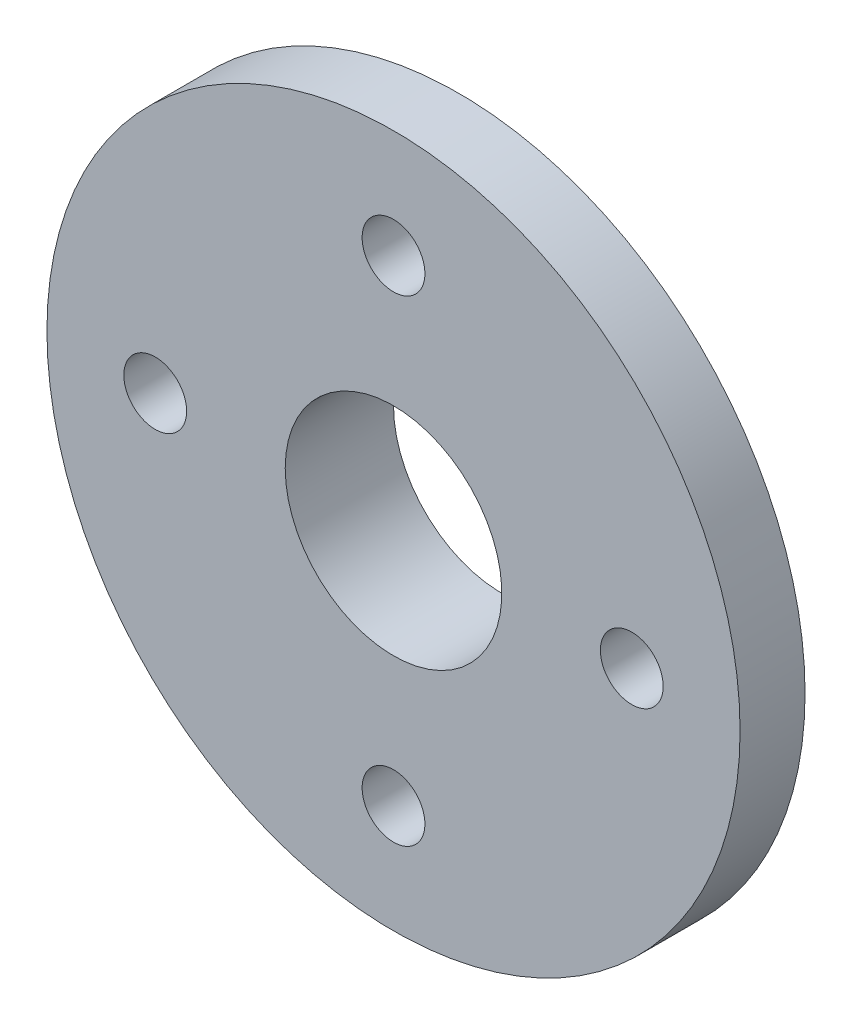
ISO-10303-21;
HEADER;
FILE_DESCRIPTION(('STEP AP214'),'2;1');
FILE_NAME('part.step','',(''),(''),'','','');
FILE_SCHEMA(('AUTOMOTIVE_DESIGN { 1 0 10303 214 1 1 1 1 }'));
ENDSEC;
DATA;
#1=APPLICATION_CONTEXT('core data for automotive mechanical design processes');
#2=APPLICATION_PROTOCOL_DEFINITION('international standard','automotive_design',2000,#1);
#3=PRODUCT_CONTEXT('',#1,'mechanical');
#4=PRODUCT('Part','Part','',(#3));
#5=PRODUCT_RELATED_PRODUCT_CATEGORY('part','',(#4));
#6=PRODUCT_DEFINITION_FORMATION('','',#4);
#7=PRODUCT_DEFINITION_CONTEXT('part definition',#1,'design');
#8=PRODUCT_DEFINITION('design','',#6,#7);
#9=PRODUCT_DEFINITION_SHAPE('','',#8);
#10=(LENGTH_UNIT() NAMED_UNIT(*) SI_UNIT(.MILLI.,.METRE.));
#11=(NAMED_UNIT(*) PLANE_ANGLE_UNIT() SI_UNIT($,.RADIAN.));
#12=(NAMED_UNIT(*) SI_UNIT($,.STERADIAN.) SOLID_ANGLE_UNIT());
#13=UNCERTAINTY_MEASURE_WITH_UNIT(LENGTH_MEASURE(1.E-05),#10,'distance_accuracy_value','');
#14=(GEOMETRIC_REPRESENTATION_CONTEXT(3) GLOBAL_UNCERTAINTY_ASSIGNED_CONTEXT((#13)) GLOBAL_UNIT_ASSIGNED_CONTEXT((#10,
#11,#12)) REPRESENTATION_CONTEXT('',''));
#15=CARTESIAN_POINT('',(0.,0.,0.));
#16=DIRECTION('',(0.,0.,1.));
#17=DIRECTION('',(1.,0.,0.));
#18=AXIS2_PLACEMENT_3D('',#15,#16,#17);
#19=CARTESIAN_POINT('',(4.29530351866679,-1.2254529962892,601.712583836907));
#20=DIRECTION('',(0.,0.,-1.));
#21=DIRECTION('',(-1.,0.,0.));
#22=AXIS2_PLACEMENT_3D('',#19,#20,#21);
#23=PLANE('',#22);
#24=CARTESIAN_POINT('',(4.29530351866679,-1.2254529962892,601.712583836907));
#25=DIRECTION('',(0.,0.,-1.));
#26=DIRECTION('',(-1.,0.,0.));
#27=AXIS2_PLACEMENT_3D('',#24,#25,#26);
#28=CIRCLE('',#27,8.);
#29=CARTESIAN_POINT('',(-3.70469648133321,-1.2254529962892,601.712583836907));
#30=VERTEX_POINT('',#29);
#31=EDGE_CURVE('E10',#30,#30,#28,.T.);
#32=ORIENTED_EDGE('',*,*,#31,.T.);
#33=EDGE_LOOP('',(#32));
#34=FACE_BOUND('',#33,.T.);
#35=CARTESIAN_POINT('',(4.29530351866679,-1.2254529962892,601.712583836907));
#36=DIRECTION('',(0.,0.,-1.));
#37=DIRECTION('',(-1.,0.,0.));
#38=AXIS2_PLACEMENT_3D('',#35,#36,#37);
#39=CIRCLE('',#38,5.);
#40=CARTESIAN_POINT('',(-0.70469648133321,-1.2254529962892,601.712583836907));
#41=VERTEX_POINT('',#40);
#42=EDGE_CURVE('E40',#41,#41,#39,.T.);
#43=ORIENTED_EDGE('',*,*,#42,.F.);
#44=EDGE_LOOP('',(#43));
#45=FACE_BOUND('',#44,.T.);
#46=ADVANCED_FACE('F33',(#34,#45),#23,.T.);
#47=CARTESIAN_POINT('',(4.29530351866679,-1.2254529962892,606.712583836907));
#48=DIRECTION('',(0.,0.,-1.));
#49=DIRECTION('',(-1.,0.,0.));
#50=AXIS2_PLACEMENT_3D('',#47,#48,#49);
#51=PLANE('',#50);
#52=CARTESIAN_POINT('',(4.2953035186669,9.7745470037108,606.712583836907));
#53=DIRECTION('',(0.,0.,-1.));
#54=DIRECTION('',(-1.,0.,0.));
#55=AXIS2_PLACEMENT_3D('',#52,#53,#54);
#56=CIRCLE('',#55,1.45);
#57=CARTESIAN_POINT('',(2.84530351866691,9.7745470037108,606.712583836907));
#58=VERTEX_POINT('',#57);
#59=EDGE_CURVE('E77',#58,#58,#56,.T.);
#60=ORIENTED_EDGE('',*,*,#59,.T.);
#61=EDGE_LOOP('',(#60));
#62=FACE_BOUND('',#61,.T.);
#63=CARTESIAN_POINT('',(-6.70469648133321,-1.2254529962892,606.712583836907));
#64=DIRECTION('',(0.,0.,-1.));
#65=DIRECTION('',(-1.,0.,0.));
#66=AXIS2_PLACEMENT_3D('',#63,#64,#65);
#67=CIRCLE('',#66,1.45);
#68=CARTESIAN_POINT('',(-8.15469648133321,-1.2254529962892,606.712583836907));
#69=VERTEX_POINT('',#68);
#70=EDGE_CURVE('E71',#69,#69,#67,.T.);
#71=ORIENTED_EDGE('',*,*,#70,.T.);
#72=EDGE_LOOP('',(#71));
#73=FACE_BOUND('',#72,.T.);
#74=CARTESIAN_POINT('',(4.29530351866675,-12.2254529962892,606.712583836907));
#75=DIRECTION('',(0.,0.,-1.));
#76=DIRECTION('',(-1.,0.,0.));
#77=AXIS2_PLACEMENT_3D('',#74,#75,#76);
#78=CIRCLE('',#77,1.45);
#79=CARTESIAN_POINT('',(2.84530351866675,-12.2254529962892,606.712583836907));
#80=VERTEX_POINT('',#79);
#81=EDGE_CURVE('E65',#80,#80,#78,.T.);
#82=ORIENTED_EDGE('',*,*,#81,.T.);
#83=EDGE_LOOP('',(#82));
#84=FACE_BOUND('',#83,.T.);
#85=CARTESIAN_POINT('',(15.2953035186668,-1.2254529962892,606.712583836907));
#86=DIRECTION('',(0.,0.,-1.));
#87=DIRECTION('',(-1.,0.,0.));
#88=AXIS2_PLACEMENT_3D('',#85,#86,#87);
#89=CIRCLE('',#88,1.45);
#90=CARTESIAN_POINT('',(13.8453035186668,-1.2254529962892,606.712583836907));
#91=VERTEX_POINT('',#90);
#92=EDGE_CURVE('E59',#91,#91,#89,.T.);
#93=ORIENTED_EDGE('',*,*,#92,.T.);
#94=EDGE_LOOP('',(#93));
#95=FACE_BOUND('',#94,.T.);
#96=CARTESIAN_POINT('',(4.29530351866679,-1.2254529962892,606.712583836907));
#97=DIRECTION('',(0.,0.,-1.));
#98=DIRECTION('',(-1.,0.,0.));
#99=AXIS2_PLACEMENT_3D('',#96,#97,#98);
#100=CIRCLE('',#99,16.);
#101=CARTESIAN_POINT('',(-11.7046964813332,-1.2254529962892,606.712583836907));
#102=VERTEX_POINT('',#101);
#103=EDGE_CURVE('E51',#102,#102,#100,.T.);
#104=ORIENTED_EDGE('',*,*,#103,.F.);
#105=EDGE_LOOP('',(#104));
#106=FACE_BOUND('',#105,.T.);
#107=CARTESIAN_POINT('',(4.29530351866679,-1.2254529962892,606.712583836907));
#108=DIRECTION('',(0.,0.,-1.));
#109=DIRECTION('',(-1.,0.,0.));
#110=AXIS2_PLACEMENT_3D('',#107,#108,#109);
#111=CIRCLE('',#110,5.);
#112=CARTESIAN_POINT('',(-0.70469648133321,-1.2254529962892,606.712583836907));
#113=VERTEX_POINT('',#112);
#114=EDGE_CURVE('E44',#113,#113,#111,.T.);
#115=ORIENTED_EDGE('',*,*,#114,.T.);
#116=EDGE_LOOP('',(#115));
#117=FACE_BOUND('',#116,.T.);
#118=ADVANCED_FACE('F104',(#62,#73,#84,#95,#106,#117),#51,.F.);
#119=CARTESIAN_POINT('',(4.29530351866679,-1.2254529962892,601.712583836907));
#120=DIRECTION('',(0.,0.,1.));
#121=DIRECTION('',(1.,0.,0.));
#122=AXIS2_PLACEMENT_3D('',#119,#120,#121);
#123=CYLINDRICAL_SURFACE('',#122,8.);
#124=CARTESIAN_POINT('',(4.29530351866679,-1.2254529962892,603.712583836907));
#125=DIRECTION('',(0.,0.,-1.));
#126=DIRECTION('',(-1.,0.,0.));
#127=AXIS2_PLACEMENT_3D('',#124,#125,#126);
#128=CIRCLE('',#127,8.);
#129=CARTESIAN_POINT('',(-3.70469648133321,-1.2254529962892,603.712583836907));
#130=VERTEX_POINT('',#129);
#131=EDGE_CURVE('E54',#130,#130,#128,.T.);
#132=ORIENTED_EDGE('',*,*,#131,.T.);
#133=EDGE_LOOP('',(#132));
#134=FACE_BOUND('',#133,.T.);
#135=ORIENTED_EDGE('',*,*,#31,.F.);
#136=EDGE_LOOP('',(#135));
#137=FACE_BOUND('',#136,.T.);
#138=ADVANCED_FACE('F35',(#134,#137),#123,.T.);
#139=CARTESIAN_POINT('',(4.29530351866679,-1.2254529962892,601.712583836907));
#140=DIRECTION('',(0.,0.,1.));
#141=DIRECTION('',(1.,0.,0.));
#142=AXIS2_PLACEMENT_3D('',#139,#140,#141);
#143=CYLINDRICAL_SURFACE('',#142,5.);
#144=ORIENTED_EDGE('',*,*,#42,.T.);
#145=EDGE_LOOP('',(#144));
#146=FACE_BOUND('',#145,.T.);
#147=ORIENTED_EDGE('',*,*,#114,.F.);
#148=EDGE_LOOP('',(#147));
#149=FACE_BOUND('',#148,.T.);
#150=ADVANCED_FACE('F90',(#146,#149),#143,.F.);
#151=CARTESIAN_POINT('',(4.29530351866679,-1.2254529962892,603.712583836907));
#152=DIRECTION('',(0.,0.,-1.));
#153=DIRECTION('',(-1.,0.,0.));
#154=AXIS2_PLACEMENT_3D('',#151,#152,#153);
#155=PLANE('',#154);
#156=CARTESIAN_POINT('',(4.2953035186669,9.7745470037108,603.712583836907));
#157=DIRECTION('',(0.,0.,-1.));
#158=DIRECTION('',(-1.,0.,0.));
#159=AXIS2_PLACEMENT_3D('',#156,#157,#158);
#160=CIRCLE('',#159,1.45);
#161=CARTESIAN_POINT('',(2.84530351866691,9.7745470037108,603.712583836907));
#162=VERTEX_POINT('',#161);
#163=EDGE_CURVE('E80',#162,#162,#160,.T.);
#164=ORIENTED_EDGE('',*,*,#163,.F.);
#165=EDGE_LOOP('',(#164));
#166=FACE_BOUND('',#165,.T.);
#167=CARTESIAN_POINT('',(-6.70469648133321,-1.2254529962892,603.712583836907));
#168=DIRECTION('',(0.,0.,-1.));
#169=DIRECTION('',(-1.,0.,0.));
#170=AXIS2_PLACEMENT_3D('',#167,#168,#169);
#171=CIRCLE('',#170,1.45);
#172=CARTESIAN_POINT('',(-8.15469648133321,-1.2254529962892,603.712583836907));
#173=VERTEX_POINT('',#172);
#174=EDGE_CURVE('E74',#173,#173,#171,.T.);
#175=ORIENTED_EDGE('',*,*,#174,.F.);
#176=EDGE_LOOP('',(#175));
#177=FACE_BOUND('',#176,.T.);
#178=CARTESIAN_POINT('',(4.29530351866675,-12.2254529962892,603.712583836907));
#179=DIRECTION('',(0.,0.,-1.));
#180=DIRECTION('',(-1.,0.,0.));
#181=AXIS2_PLACEMENT_3D('',#178,#179,#180);
#182=CIRCLE('',#181,1.45);
#183=CARTESIAN_POINT('',(2.84530351866675,-12.2254529962892,603.712583836907));
#184=VERTEX_POINT('',#183);
#185=EDGE_CURVE('E68',#184,#184,#182,.T.);
#186=ORIENTED_EDGE('',*,*,#185,.F.);
#187=EDGE_LOOP('',(#186));
#188=FACE_BOUND('',#187,.T.);
#189=CARTESIAN_POINT('',(15.2953035186668,-1.2254529962892,603.712583836907));
#190=DIRECTION('',(0.,0.,-1.));
#191=DIRECTION('',(-1.,0.,0.));
#192=AXIS2_PLACEMENT_3D('',#189,#190,#191);
#193=CIRCLE('',#192,1.45);
#194=CARTESIAN_POINT('',(13.8453035186668,-1.2254529962892,603.712583836907));
#195=VERTEX_POINT('',#194);
#196=EDGE_CURVE('E62',#195,#195,#193,.T.);
#197=ORIENTED_EDGE('',*,*,#196,.F.);
#198=EDGE_LOOP('',(#197));
#199=FACE_BOUND('',#198,.T.);
#200=CARTESIAN_POINT('',(4.29530351866679,-1.2254529962892,603.712583836907));
#201=DIRECTION('',(0.,0.,-1.));
#202=DIRECTION('',(-1.,0.,0.));
#203=AXIS2_PLACEMENT_3D('',#200,#201,#202);
#204=CIRCLE('',#203,16.);
#205=CARTESIAN_POINT('',(-11.7046964813332,-1.2254529962892,603.712583836907));
#206=VERTEX_POINT('',#205);
#207=EDGE_CURVE('E49',#206,#206,#204,.T.);
#208=ORIENTED_EDGE('',*,*,#207,.T.);
#209=EDGE_LOOP('',(#208));
#210=FACE_BOUND('',#209,.T.);
#211=ORIENTED_EDGE('',*,*,#131,.F.);
#212=EDGE_LOOP('',(#211));
#213=FACE_BOUND('',#212,.T.);
#214=ADVANCED_FACE('F86',(#166,#177,#188,#199,#210,#213),#155,.T.);
#215=CARTESIAN_POINT('',(4.29530351866679,-1.2254529962892,603.712583836907));
#216=DIRECTION('',(0.,0.,1.));
#217=DIRECTION('',(1.,0.,0.));
#218=AXIS2_PLACEMENT_3D('',#215,#216,#217);
#219=CYLINDRICAL_SURFACE('',#218,16.);
#220=ORIENTED_EDGE('',*,*,#207,.F.);
#221=EDGE_LOOP('',(#220));
#222=FACE_BOUND('',#221,.T.);
#223=ORIENTED_EDGE('',*,*,#103,.T.);
#224=EDGE_LOOP('',(#223));
#225=FACE_BOUND('',#224,.T.);
#226=ADVANCED_FACE('F89',(#222,#225),#219,.T.);
#227=CARTESIAN_POINT('',(15.2953035186668,-1.2254529962892,603.712583836907));
#228=DIRECTION('',(0.,0.,-1.));
#229=DIRECTION('',(-1.,0.,0.));
#230=AXIS2_PLACEMENT_3D('',#227,#228,#229);
#231=CYLINDRICAL_SURFACE('',#230,1.45);
#232=ORIENTED_EDGE('',*,*,#92,.F.);
#233=EDGE_LOOP('',(#232));
#234=FACE_BOUND('',#233,.T.);
#235=ORIENTED_EDGE('',*,*,#196,.T.);
#236=EDGE_LOOP('',(#235));
#237=FACE_BOUND('',#236,.T.);
#238=ADVANCED_FACE('F118',(#234,#237),#231,.F.);
#239=CARTESIAN_POINT('',(4.29530351866675,-12.2254529962892,603.712583836907));
#240=DIRECTION('',(0.,0.,-1.));
#241=DIRECTION('',(-1.,0.,0.));
#242=AXIS2_PLACEMENT_3D('',#239,#240,#241);
#243=CYLINDRICAL_SURFACE('',#242,1.45);
#244=ORIENTED_EDGE('',*,*,#81,.F.);
#245=EDGE_LOOP('',(#244));
#246=FACE_BOUND('',#245,.T.);
#247=ORIENTED_EDGE('',*,*,#185,.T.);
#248=EDGE_LOOP('',(#247));
#249=FACE_BOUND('',#248,.T.);
#250=ADVANCED_FACE('F123',(#246,#249),#243,.F.);
#251=CARTESIAN_POINT('',(-6.70469648133321,-1.2254529962892,603.712583836907));
#252=DIRECTION('',(0.,0.,-1.));
#253=DIRECTION('',(-1.,0.,0.));
#254=AXIS2_PLACEMENT_3D('',#251,#252,#253);
#255=CYLINDRICAL_SURFACE('',#254,1.45);
#256=ORIENTED_EDGE('',*,*,#70,.F.);
#257=EDGE_LOOP('',(#256));
#258=FACE_BOUND('',#257,.T.);
#259=ORIENTED_EDGE('',*,*,#174,.T.);
#260=EDGE_LOOP('',(#259));
#261=FACE_BOUND('',#260,.T.);
#262=ADVANCED_FACE('F127',(#258,#261),#255,.F.);
#263=CARTESIAN_POINT('',(4.2953035186669,9.7745470037108,603.712583836907));
#264=DIRECTION('',(0.,0.,-1.));
#265=DIRECTION('',(-1.,0.,0.));
#266=AXIS2_PLACEMENT_3D('',#263,#264,#265);
#267=CYLINDRICAL_SURFACE('',#266,1.45);
#268=ORIENTED_EDGE('',*,*,#59,.F.);
#269=EDGE_LOOP('',(#268));
#270=FACE_BOUND('',#269,.T.);
#271=ORIENTED_EDGE('',*,*,#163,.T.);
#272=EDGE_LOOP('',(#271));
#273=FACE_BOUND('',#272,.T.);
#274=ADVANCED_FACE('F84',(#270,#273),#267,.F.);
#275=CLOSED_SHELL('',(#46,#118,#138,#150,#214,#226,#238,#250,#262,#274));
#276=MANIFOLD_SOLID_BREP('B2',#275);
#277=ADVANCED_BREP_SHAPE_REPRESENTATION('',(#18,#276),#14);
#278=SHAPE_DEFINITION_REPRESENTATION(#9,#277);
ENDSEC;
END-ISO-10303-21;
